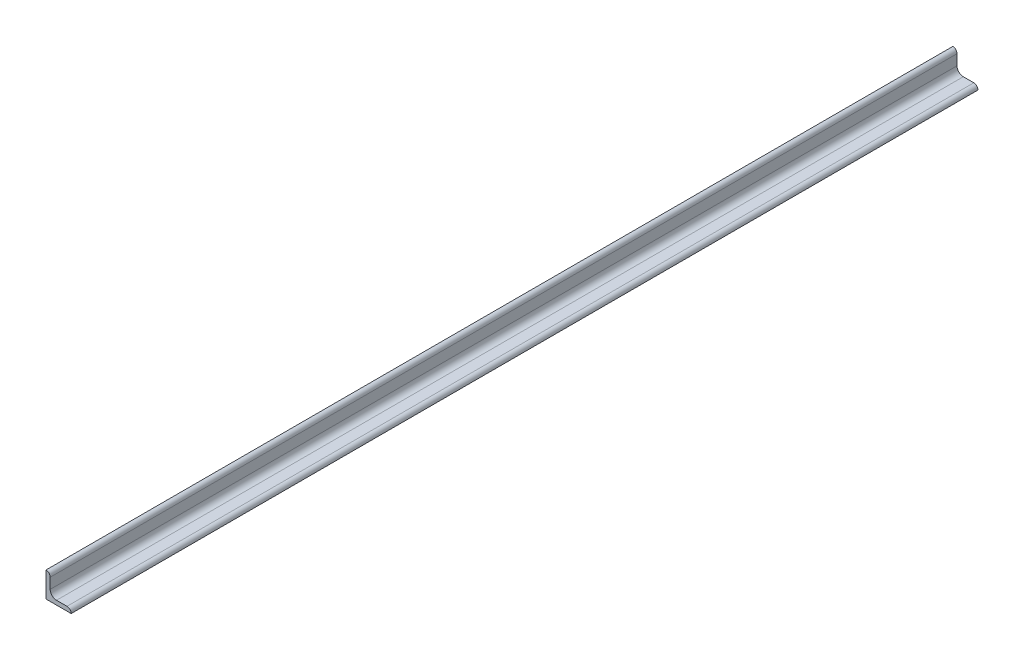
ISO-10303-21;
HEADER;
FILE_DESCRIPTION(('STEP AP214'),'2;1');
FILE_NAME('part.step','',(''),(''),'','','');
FILE_SCHEMA(('AUTOMOTIVE_DESIGN { 1 0 10303 214 1 1 1 1 }'));
ENDSEC;
DATA;
#1=APPLICATION_CONTEXT('core data for automotive mechanical design processes');
#2=APPLICATION_PROTOCOL_DEFINITION('international standard','automotive_design',2000,#1);
#3=PRODUCT_CONTEXT('',#1,'mechanical');
#4=PRODUCT('Part','Part','',(#3));
#5=PRODUCT_RELATED_PRODUCT_CATEGORY('part','',(#4));
#6=PRODUCT_DEFINITION_FORMATION('','',#4);
#7=PRODUCT_DEFINITION_CONTEXT('part definition',#1,'design');
#8=PRODUCT_DEFINITION('design','',#6,#7);
#9=PRODUCT_DEFINITION_SHAPE('','',#8);
#10=(LENGTH_UNIT() NAMED_UNIT(*) SI_UNIT(.MILLI.,.METRE.));
#11=(NAMED_UNIT(*) PLANE_ANGLE_UNIT() SI_UNIT($,.RADIAN.));
#12=(NAMED_UNIT(*) SI_UNIT($,.STERADIAN.) SOLID_ANGLE_UNIT());
#13=UNCERTAINTY_MEASURE_WITH_UNIT(LENGTH_MEASURE(1.E-05),#10,'distance_accuracy_value','');
#14=(GEOMETRIC_REPRESENTATION_CONTEXT(3) GLOBAL_UNCERTAINTY_ASSIGNED_CONTEXT((#13)) GLOBAL_UNIT_ASSIGNED_CONTEXT((#10,
#11,#12)) REPRESENTATION_CONTEXT('',''));
#15=CARTESIAN_POINT('',(0.,0.,0.));
#16=DIRECTION('',(0.,0.,1.));
#17=DIRECTION('',(1.,0.,0.));
#18=AXIS2_PLACEMENT_3D('',#15,#16,#17);
#19=CARTESIAN_POINT('',(19.05,0.,342.9));
#20=DIRECTION('',(0.,1.,0.));
#21=DIRECTION('',(-1.,0.,0.));
#22=AXIS2_PLACEMENT_3D('',#19,#20,#21);
#23=PLANE('',#22);
#24=DIRECTION('',(1.,0.,0.));
#25=VECTOR('',#24,1.);
#26=CARTESIAN_POINT('',(19.05,0.,-342.9));
#27=LINE('',#26,#25);
#28=CARTESIAN_POINT('',(0.,0.,-342.9));
#29=VERTEX_POINT('',#28);
#30=CARTESIAN_POINT('',(19.05,0.,-342.9));
#31=VERTEX_POINT('',#30);
#32=EDGE_CURVE('E135',#29,#31,#27,.T.);
#33=ORIENTED_EDGE('',*,*,#32,.T.);
#34=DIRECTION('',(0.,0.,-1.));
#35=VECTOR('',#34,1.);
#36=CARTESIAN_POINT('',(19.05,0.,342.9));
#37=LINE('',#36,#35);
#38=CARTESIAN_POINT('',(19.05,0.,342.9));
#39=VERTEX_POINT('',#38);
#40=EDGE_CURVE('E11',#39,#31,#37,.T.);
#41=ORIENTED_EDGE('',*,*,#40,.F.);
#42=DIRECTION('',(1.,0.,0.));
#43=VECTOR('',#42,1.);
#44=CARTESIAN_POINT('',(19.05,0.,342.9));
#45=LINE('',#44,#43);
#46=CARTESIAN_POINT('',(0.,0.,342.9));
#47=VERTEX_POINT('',#46);
#48=EDGE_CURVE('E151',#47,#39,#45,.T.);
#49=ORIENTED_EDGE('',*,*,#48,.F.);
#50=DIRECTION('',(0.,0.,-1.));
#51=VECTOR('',#50,1.);
#52=CARTESIAN_POINT('',(0.,0.,342.9));
#53=LINE('',#52,#51);
#54=EDGE_CURVE('E131',#47,#29,#53,.T.);
#55=ORIENTED_EDGE('',*,*,#54,.T.);
#56=EDGE_LOOP('',(#33,#41,#49,#55));
#57=FACE_BOUND('',#56,.T.);
#58=ADVANCED_FACE('F33',(#57),#23,.F.);
#59=CARTESIAN_POINT('',(19.05,0.00507999999999611,342.9));
#60=DIRECTION('',(-1.,0.,0.));
#61=DIRECTION('',(0.,0.,1.));
#62=AXIS2_PLACEMENT_3D('',#59,#60,#61);
#63=PLANE('',#62);
#64=DIRECTION('',(0.,1.,0.));
#65=VECTOR('',#64,1.);
#66=CARTESIAN_POINT('',(19.05,0.00507999999999611,-342.9));
#67=LINE('',#66,#65);
#68=CARTESIAN_POINT('',(19.05,0.00507999999999611,-342.9));
#69=VERTEX_POINT('',#68);
#70=EDGE_CURVE('E138',#31,#69,#67,.T.);
#71=ORIENTED_EDGE('',*,*,#70,.T.);
#72=DIRECTION('',(0.,0.,-1.));
#73=VECTOR('',#72,1.);
#74=CARTESIAN_POINT('',(19.05,0.00507999999999611,342.9));
#75=LINE('',#74,#73);
#76=CARTESIAN_POINT('',(19.05,0.00507999999999611,342.9));
#77=VERTEX_POINT('',#76);
#78=EDGE_CURVE('E41',#77,#69,#75,.T.);
#79=ORIENTED_EDGE('',*,*,#78,.F.);
#80=DIRECTION('',(0.,1.,0.));
#81=VECTOR('',#80,1.);
#82=CARTESIAN_POINT('',(19.05,0.00507999999999611,342.9));
#83=LINE('',#82,#81);
#84=EDGE_CURVE('E95',#39,#77,#83,.T.);
#85=ORIENTED_EDGE('',*,*,#84,.F.);
#86=ORIENTED_EDGE('',*,*,#40,.T.);
#87=EDGE_LOOP('',(#71,#79,#85,#86));
#88=FACE_BOUND('',#87,.T.);
#89=ADVANCED_FACE('F194',(#88),#63,.F.);
#90=CARTESIAN_POINT('',(15.88008,0.00507999999999573,342.9));
#91=DIRECTION('',(0.,0.,-1.));
#92=DIRECTION('',(-1.,0.,0.));
#93=AXIS2_PLACEMENT_3D('',#90,#91,#92);
#94=CYLINDRICAL_SURFACE('',#93,3.16992);
#95=CARTESIAN_POINT('',(15.88008,0.00507999999999573,-342.9));
#96=DIRECTION('',(0.,0.,1.));
#97=DIRECTION('',(1.,0.,0.));
#98=AXIS2_PLACEMENT_3D('',#95,#96,#97);
#99=CIRCLE('',#98,3.16992);
#100=CARTESIAN_POINT('',(15.88008,3.17499999999999,-342.9));
#101=VERTEX_POINT('',#100);
#102=EDGE_CURVE('E140',#69,#101,#99,.T.);
#103=ORIENTED_EDGE('',*,*,#102,.T.);
#104=DIRECTION('',(0.,0.,-1.));
#105=VECTOR('',#104,1.);
#106=CARTESIAN_POINT('',(15.88008,3.17499999999999,342.9));
#107=LINE('',#106,#105);
#108=CARTESIAN_POINT('',(15.88008,3.17499999999999,342.9));
#109=VERTEX_POINT('',#108);
#110=EDGE_CURVE('E161',#109,#101,#107,.T.);
#111=ORIENTED_EDGE('',*,*,#110,.F.);
#112=CARTESIAN_POINT('',(15.88008,0.00507999999999573,342.9));
#113=DIRECTION('',(0.,0.,1.));
#114=DIRECTION('',(1.,0.,0.));
#115=AXIS2_PLACEMENT_3D('',#112,#113,#114);
#116=CIRCLE('',#115,3.16992);
#117=EDGE_CURVE('E169',#77,#109,#116,.T.);
#118=ORIENTED_EDGE('',*,*,#117,.F.);
#119=ORIENTED_EDGE('',*,*,#78,.T.);
#120=EDGE_LOOP('',(#103,#111,#118,#119));
#121=FACE_BOUND('',#120,.T.);
#122=ADVANCED_FACE('F167',(#121),#94,.T.);
#123=CARTESIAN_POINT('',(7.93749999999999,3.175,342.9));
#124=DIRECTION('',(0.,-1.,0.));
#125=DIRECTION('',(1.,0.,0.));
#126=AXIS2_PLACEMENT_3D('',#123,#124,#125);
#127=PLANE('',#126);
#128=DIRECTION('',(-1.,0.,0.));
#129=VECTOR('',#128,1.);
#130=CARTESIAN_POINT('',(7.93749999999999,3.175,-342.9));
#131=LINE('',#130,#129);
#132=CARTESIAN_POINT('',(7.93749999999999,3.17499999999999,-342.9));
#133=VERTEX_POINT('',#132);
#134=EDGE_CURVE('E142',#101,#133,#131,.T.);
#135=ORIENTED_EDGE('',*,*,#134,.T.);
#136=DIRECTION('',(0.,0.,-1.));
#137=VECTOR('',#136,1.);
#138=CARTESIAN_POINT('',(7.93749999999999,3.17499999999999,342.9));
#139=LINE('',#138,#137);
#140=CARTESIAN_POINT('',(7.93749999999999,3.17499999999999,342.9));
#141=VERTEX_POINT('',#140);
#142=EDGE_CURVE('E158',#141,#133,#139,.T.);
#143=ORIENTED_EDGE('',*,*,#142,.F.);
#144=DIRECTION('',(-1.,0.,0.));
#145=VECTOR('',#144,1.);
#146=CARTESIAN_POINT('',(7.93749999999999,3.175,342.9));
#147=LINE('',#146,#145);
#148=EDGE_CURVE('E185',#109,#141,#147,.T.);
#149=ORIENTED_EDGE('',*,*,#148,.F.);
#150=ORIENTED_EDGE('',*,*,#110,.T.);
#151=EDGE_LOOP('',(#135,#143,#149,#150));
#152=FACE_BOUND('',#151,.T.);
#153=ADVANCED_FACE('F178',(#152),#127,.F.);
#154=CARTESIAN_POINT('',(7.93749999999999,7.93749999999999,342.9));
#155=DIRECTION('',(0.,0.,-1.));
#156=DIRECTION('',(-1.,0.,0.));
#157=AXIS2_PLACEMENT_3D('',#154,#155,#156);
#158=CYLINDRICAL_SURFACE('',#157,4.7625);
#159=CARTESIAN_POINT('',(7.93749999999999,7.93749999999999,-342.9));
#160=DIRECTION('',(0.,0.,-1.));
#161=DIRECTION('',(-1.,0.,0.));
#162=AXIS2_PLACEMENT_3D('',#159,#160,#161);
#163=CIRCLE('',#162,4.7625);
#164=CARTESIAN_POINT('',(3.17499999999999,7.93749999999999,-342.9));
#165=VERTEX_POINT('',#164);
#166=EDGE_CURVE('E144',#133,#165,#163,.T.);
#167=ORIENTED_EDGE('',*,*,#166,.T.);
#168=DIRECTION('',(0.,0.,-1.));
#169=VECTOR('',#168,1.);
#170=CARTESIAN_POINT('',(3.17499999999999,7.93749999999999,342.9));
#171=LINE('',#170,#169);
#172=CARTESIAN_POINT('',(3.17499999999999,7.93749999999999,342.9));
#173=VERTEX_POINT('',#172);
#174=EDGE_CURVE('E155',#173,#165,#171,.T.);
#175=ORIENTED_EDGE('',*,*,#174,.F.);
#176=CARTESIAN_POINT('',(7.93749999999999,7.93749999999999,342.9));
#177=DIRECTION('',(0.,0.,-1.));
#178=DIRECTION('',(-1.,0.,0.));
#179=AXIS2_PLACEMENT_3D('',#176,#177,#178);
#180=CIRCLE('',#179,4.7625);
#181=EDGE_CURVE('E184',#141,#173,#180,.T.);
#182=ORIENTED_EDGE('',*,*,#181,.F.);
#183=ORIENTED_EDGE('',*,*,#142,.T.);
#184=EDGE_LOOP('',(#167,#175,#182,#183));
#185=FACE_BOUND('',#184,.T.);
#186=ADVANCED_FACE('F182',(#185),#158,.F.);
#187=CARTESIAN_POINT('',(3.175,15.88008,342.9));
#188=DIRECTION('',(-1.,0.,0.));
#189=DIRECTION('',(0.,-1.,0.));
#190=AXIS2_PLACEMENT_3D('',#187,#188,#189);
#191=PLANE('',#190);
#192=DIRECTION('',(0.,1.,0.));
#193=VECTOR('',#192,1.);
#194=CARTESIAN_POINT('',(3.175,15.88008,-342.9));
#195=LINE('',#194,#193);
#196=CARTESIAN_POINT('',(3.17500000000001,15.88008,-342.9));
#197=VERTEX_POINT('',#196);
#198=EDGE_CURVE('E146',#165,#197,#195,.T.);
#199=ORIENTED_EDGE('',*,*,#198,.T.);
#200=DIRECTION('',(0.,0.,-1.));
#201=VECTOR('',#200,1.);
#202=CARTESIAN_POINT('',(3.17500000000001,15.88008,342.9));
#203=LINE('',#202,#201);
#204=CARTESIAN_POINT('',(3.17500000000001,15.88008,342.9));
#205=VERTEX_POINT('',#204);
#206=EDGE_CURVE('E126',#205,#197,#203,.T.);
#207=ORIENTED_EDGE('',*,*,#206,.F.);
#208=DIRECTION('',(0.,1.,0.));
#209=VECTOR('',#208,1.);
#210=CARTESIAN_POINT('',(3.175,15.88008,342.9));
#211=LINE('',#210,#209);
#212=EDGE_CURVE('E117',#173,#205,#211,.T.);
#213=ORIENTED_EDGE('',*,*,#212,.F.);
#214=ORIENTED_EDGE('',*,*,#174,.T.);
#215=EDGE_LOOP('',(#199,#207,#213,#214));
#216=FACE_BOUND('',#215,.T.);
#217=ADVANCED_FACE('F206',(#216),#191,.F.);
#218=CARTESIAN_POINT('',(0.00508000000000019,15.88008,342.9));
#219=DIRECTION('',(0.,0.,-1.));
#220=DIRECTION('',(-1.,0.,0.));
#221=AXIS2_PLACEMENT_3D('',#218,#219,#220);
#222=CYLINDRICAL_SURFACE('',#221,3.16992);
#223=CARTESIAN_POINT('',(0.00508000000000019,15.88008,-342.9));
#224=DIRECTION('',(0.,0.,1.));
#225=DIRECTION('',(-1.,0.,0.));
#226=AXIS2_PLACEMENT_3D('',#223,#224,#225);
#227=CIRCLE('',#226,3.16992);
#228=CARTESIAN_POINT('',(0.00508,19.05,-342.9));
#229=VERTEX_POINT('',#228);
#230=EDGE_CURVE('E125',#197,#229,#227,.T.);
#231=ORIENTED_EDGE('',*,*,#230,.T.);
#232=DIRECTION('',(0.,0.,-1.));
#233=VECTOR('',#232,1.);
#234=CARTESIAN_POINT('',(0.00508,19.05,342.9));
#235=LINE('',#234,#233);
#236=CARTESIAN_POINT('',(0.00508,19.05,342.9));
#237=VERTEX_POINT('',#236);
#238=EDGE_CURVE('E122',#237,#229,#235,.T.);
#239=ORIENTED_EDGE('',*,*,#238,.F.);
#240=CARTESIAN_POINT('',(0.00508000000000019,15.88008,342.9));
#241=DIRECTION('',(0.,0.,1.));
#242=DIRECTION('',(-1.,0.,0.));
#243=AXIS2_PLACEMENT_3D('',#240,#241,#242);
#244=CIRCLE('',#243,3.16992);
#245=EDGE_CURVE('E111',#205,#237,#244,.T.);
#246=ORIENTED_EDGE('',*,*,#245,.F.);
#247=ORIENTED_EDGE('',*,*,#206,.T.);
#248=EDGE_LOOP('',(#231,#239,#246,#247));
#249=FACE_BOUND('',#248,.T.);
#250=ADVANCED_FACE('F123',(#249),#222,.T.);
#251=CARTESIAN_POINT('',(0.,19.05,342.9));
#252=DIRECTION('',(0.,-1.,0.));
#253=DIRECTION('',(0.,0.,-1.));
#254=AXIS2_PLACEMENT_3D('',#251,#252,#253);
#255=PLANE('',#254);
#256=DIRECTION('',(-1.,0.,0.));
#257=VECTOR('',#256,1.);
#258=CARTESIAN_POINT('',(0.,19.05,-342.9));
#259=LINE('',#258,#257);
#260=CARTESIAN_POINT('',(0.,19.05,-342.9));
#261=VERTEX_POINT('',#260);
#262=EDGE_CURVE('E81',#229,#261,#259,.T.);
#263=ORIENTED_EDGE('',*,*,#262,.T.);
#264=DIRECTION('',(0.,0.,-1.));
#265=VECTOR('',#264,1.);
#266=CARTESIAN_POINT('',(0.,19.05,342.9));
#267=LINE('',#266,#265);
#268=CARTESIAN_POINT('',(0.,19.05,342.9));
#269=VERTEX_POINT('',#268);
#270=EDGE_CURVE('E127',#269,#261,#267,.T.);
#271=ORIENTED_EDGE('',*,*,#270,.F.);
#272=DIRECTION('',(-1.,0.,0.));
#273=VECTOR('',#272,1.);
#274=CARTESIAN_POINT('',(0.,19.05,342.9));
#275=LINE('',#274,#273);
#276=EDGE_CURVE('E115',#237,#269,#275,.T.);
#277=ORIENTED_EDGE('',*,*,#276,.F.);
#278=ORIENTED_EDGE('',*,*,#238,.T.);
#279=EDGE_LOOP('',(#263,#271,#277,#278));
#280=FACE_BOUND('',#279,.T.);
#281=ADVANCED_FACE('F129',(#280),#255,.F.);
#282=CARTESIAN_POINT('',(0.,0.,342.9));
#283=DIRECTION('',(1.,0.,0.));
#284=DIRECTION('',(0.,1.,0.));
#285=AXIS2_PLACEMENT_3D('',#282,#283,#284);
#286=PLANE('',#285);
#287=DIRECTION('',(0.,-1.,0.));
#288=VECTOR('',#287,1.);
#289=CARTESIAN_POINT('',(0.,0.,-342.9));
#290=LINE('',#289,#288);
#291=EDGE_CURVE('E87',#261,#29,#290,.T.);
#292=ORIENTED_EDGE('',*,*,#291,.T.);
#293=ORIENTED_EDGE('',*,*,#54,.F.);
#294=DIRECTION('',(0.,-1.,0.));
#295=VECTOR('',#294,1.);
#296=CARTESIAN_POINT('',(0.,0.,342.9));
#297=LINE('',#296,#295);
#298=EDGE_CURVE('E49',#269,#47,#297,.T.);
#299=ORIENTED_EDGE('',*,*,#298,.F.);
#300=ORIENTED_EDGE('',*,*,#270,.T.);
#301=EDGE_LOOP('',(#292,#293,#299,#300));
#302=FACE_BOUND('',#301,.T.);
#303=ADVANCED_FACE('F214',(#302),#286,.F.);
#304=CARTESIAN_POINT('',(0.00508000000000019,15.88008,342.9));
#305=DIRECTION('',(0.,0.,-1.));
#306=DIRECTION('',(-1.,0.,0.));
#307=AXIS2_PLACEMENT_3D('',#304,#305,#306);
#308=PLANE('',#307);
#309=ORIENTED_EDGE('',*,*,#48,.T.);
#310=ORIENTED_EDGE('',*,*,#84,.T.);
#311=ORIENTED_EDGE('',*,*,#117,.T.);
#312=ORIENTED_EDGE('',*,*,#148,.T.);
#313=ORIENTED_EDGE('',*,*,#181,.T.);
#314=ORIENTED_EDGE('',*,*,#212,.T.);
#315=ORIENTED_EDGE('',*,*,#245,.T.);
#316=ORIENTED_EDGE('',*,*,#276,.T.);
#317=ORIENTED_EDGE('',*,*,#298,.T.);
#318=EDGE_LOOP('',(#309,#310,#311,#312,#313,#314,#315,#316,#317));
#319=FACE_BOUND('',#318,.T.);
#320=ADVANCED_FACE('F113',(#319),#308,.F.);
#321=CARTESIAN_POINT('',(0.00508000000000019,15.88008,-342.9));
#322=DIRECTION('',(0.,0.,-1.));
#323=DIRECTION('',(-1.,0.,0.));
#324=AXIS2_PLACEMENT_3D('',#321,#322,#323);
#325=PLANE('',#324);
#326=ORIENTED_EDGE('',*,*,#32,.F.);
#327=ORIENTED_EDGE('',*,*,#291,.F.);
#328=ORIENTED_EDGE('',*,*,#262,.F.);
#329=ORIENTED_EDGE('',*,*,#230,.F.);
#330=ORIENTED_EDGE('',*,*,#198,.F.);
#331=ORIENTED_EDGE('',*,*,#166,.F.);
#332=ORIENTED_EDGE('',*,*,#134,.F.);
#333=ORIENTED_EDGE('',*,*,#102,.F.);
#334=ORIENTED_EDGE('',*,*,#70,.F.);
#335=EDGE_LOOP('',(#326,#327,#328,#329,#330,#331,#332,#333,#334));
#336=FACE_BOUND('',#335,.T.);
#337=ADVANCED_FACE('F173',(#336),#325,.T.);
#338=CLOSED_SHELL('',(#58,#89,#122,#153,#186,#217,#250,#281,#303,#320,#337));
#339=MANIFOLD_SOLID_BREP('B2',#338);
#340=ADVANCED_BREP_SHAPE_REPRESENTATION('',(#18,#339),#14);
#341=SHAPE_DEFINITION_REPRESENTATION(#9,#340);
ENDSEC;
END-ISO-10303-21;
